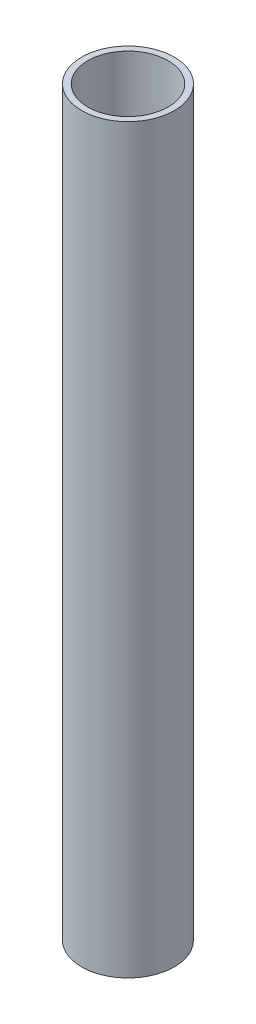
ISO-10303-21;
HEADER;
FILE_DESCRIPTION(('STEP AP214'),'2;1');
FILE_NAME('part.step','',(''),(''),'','','');
FILE_SCHEMA(('AUTOMOTIVE_DESIGN { 1 0 10303 214 1 1 1 1 }'));
ENDSEC;
DATA;
#1=APPLICATION_CONTEXT('core data for automotive mechanical design processes');
#2=APPLICATION_PROTOCOL_DEFINITION('international standard','automotive_design',2000,#1);
#3=PRODUCT_CONTEXT('',#1,'mechanical');
#4=PRODUCT('Part','Part','',(#3));
#5=PRODUCT_RELATED_PRODUCT_CATEGORY('part','',(#4));
#6=PRODUCT_DEFINITION_FORMATION('','',#4);
#7=PRODUCT_DEFINITION_CONTEXT('part definition',#1,'design');
#8=PRODUCT_DEFINITION('design','',#6,#7);
#9=PRODUCT_DEFINITION_SHAPE('','',#8);
#10=(LENGTH_UNIT() NAMED_UNIT(*) SI_UNIT(.MILLI.,.METRE.));
#11=(NAMED_UNIT(*) PLANE_ANGLE_UNIT() SI_UNIT($,.RADIAN.));
#12=(NAMED_UNIT(*) SI_UNIT($,.STERADIAN.) SOLID_ANGLE_UNIT());
#13=UNCERTAINTY_MEASURE_WITH_UNIT(LENGTH_MEASURE(1.E-05),#10,'distance_accuracy_value','');
#14=(GEOMETRIC_REPRESENTATION_CONTEXT(3) GLOBAL_UNCERTAINTY_ASSIGNED_CONTEXT((#13)) GLOBAL_UNIT_ASSIGNED_CONTEXT((#10,
#11,#12)) REPRESENTATION_CONTEXT('',''));
#15=CARTESIAN_POINT('',(0.,0.,0.));
#16=DIRECTION('',(0.,0.,1.));
#17=DIRECTION('',(1.,0.,0.));
#18=AXIS2_PLACEMENT_3D('',#15,#16,#17);
#19=CARTESIAN_POINT('',(0.,152.4,0.));
#20=DIRECTION('',(0.,1.,0.));
#21=DIRECTION('',(0.,0.,1.));
#22=AXIS2_PLACEMENT_3D('',#19,#20,#21);
#23=PLANE('',#22);
#24=CARTESIAN_POINT('',(0.,152.4,0.));
#25=DIRECTION('',(0.,1.,0.));
#26=DIRECTION('',(0.,0.,1.));
#27=AXIS2_PLACEMENT_3D('',#24,#25,#26);
#28=CIRCLE('',#27,9.525);
#29=CARTESIAN_POINT('',(0.,152.4,9.525));
#30=VERTEX_POINT('',#29);
#31=EDGE_CURVE('E10',#30,#30,#28,.T.);
#32=ORIENTED_EDGE('',*,*,#31,.T.);
#33=EDGE_LOOP('',(#32));
#34=FACE_BOUND('',#33,.T.);
#35=CARTESIAN_POINT('',(0.,152.4,0.));
#36=DIRECTION('',(0.,1.,0.));
#37=DIRECTION('',(0.,0.,1.));
#38=AXIS2_PLACEMENT_3D('',#35,#36,#37);
#39=CIRCLE('',#38,8.255);
#40=CARTESIAN_POINT('',(0.,152.4,8.255));
#41=VERTEX_POINT('',#40);
#42=EDGE_CURVE('E50',#41,#41,#39,.T.);
#43=ORIENTED_EDGE('',*,*,#42,.F.);
#44=EDGE_LOOP('',(#43));
#45=FACE_BOUND('',#44,.T.);
#46=ADVANCED_FACE('F37',(#34,#45),#23,.T.);
#47=CARTESIAN_POINT('',(0.,0.,0.));
#48=DIRECTION('',(0.,1.,0.));
#49=DIRECTION('',(0.,0.,1.));
#50=AXIS2_PLACEMENT_3D('',#47,#48,#49);
#51=PLANE('',#50);
#52=CARTESIAN_POINT('',(0.,0.,0.));
#53=DIRECTION('',(0.,1.,0.));
#54=DIRECTION('',(0.,0.,1.));
#55=AXIS2_PLACEMENT_3D('',#52,#53,#54);
#56=CIRCLE('',#55,9.525);
#57=CARTESIAN_POINT('',(0.,0.,9.525));
#58=VERTEX_POINT('',#57);
#59=EDGE_CURVE('E41',#58,#58,#56,.T.);
#60=ORIENTED_EDGE('',*,*,#59,.F.);
#61=EDGE_LOOP('',(#60));
#62=FACE_BOUND('',#61,.T.);
#63=CARTESIAN_POINT('',(0.,0.,0.));
#64=DIRECTION('',(0.,1.,0.));
#65=DIRECTION('',(0.,0.,1.));
#66=AXIS2_PLACEMENT_3D('',#63,#64,#65);
#67=CIRCLE('',#66,8.255);
#68=CARTESIAN_POINT('',(0.,0.,8.255));
#69=VERTEX_POINT('',#68);
#70=EDGE_CURVE('E52',#69,#69,#67,.T.);
#71=ORIENTED_EDGE('',*,*,#70,.T.);
#72=EDGE_LOOP('',(#71));
#73=FACE_BOUND('',#72,.T.);
#74=ADVANCED_FACE('F64',(#62,#73),#51,.F.);
#75=CARTESIAN_POINT('',(0.,152.4,0.));
#76=DIRECTION('',(0.,-1.,0.));
#77=DIRECTION('',(0.,0.,-1.));
#78=AXIS2_PLACEMENT_3D('',#75,#76,#77);
#79=CYLINDRICAL_SURFACE('',#78,9.525);
#80=ORIENTED_EDGE('',*,*,#31,.F.);
#81=EDGE_LOOP('',(#80));
#82=FACE_BOUND('',#81,.T.);
#83=ORIENTED_EDGE('',*,*,#59,.T.);
#84=EDGE_LOOP('',(#83));
#85=FACE_BOUND('',#84,.T.);
#86=ADVANCED_FACE('F39',(#82,#85),#79,.T.);
#87=CARTESIAN_POINT('',(0.,152.4,0.));
#88=DIRECTION('',(0.,-1.,0.));
#89=DIRECTION('',(0.,0.,-1.));
#90=AXIS2_PLACEMENT_3D('',#87,#88,#89);
#91=CYLINDRICAL_SURFACE('',#90,8.255);
#92=ORIENTED_EDGE('',*,*,#42,.T.);
#93=EDGE_LOOP('',(#92));
#94=FACE_BOUND('',#93,.T.);
#95=ORIENTED_EDGE('',*,*,#70,.F.);
#96=EDGE_LOOP('',(#95));
#97=FACE_BOUND('',#96,.T.);
#98=ADVANCED_FACE('F60',(#94,#97),#91,.F.);
#99=CLOSED_SHELL('',(#46,#74,#86,#98));
#100=MANIFOLD_SOLID_BREP('B2',#99);
#101=ADVANCED_BREP_SHAPE_REPRESENTATION('',(#18,#100),#14);
#102=SHAPE_DEFINITION_REPRESENTATION(#9,#101);
ENDSEC;
END-ISO-10303-21;
